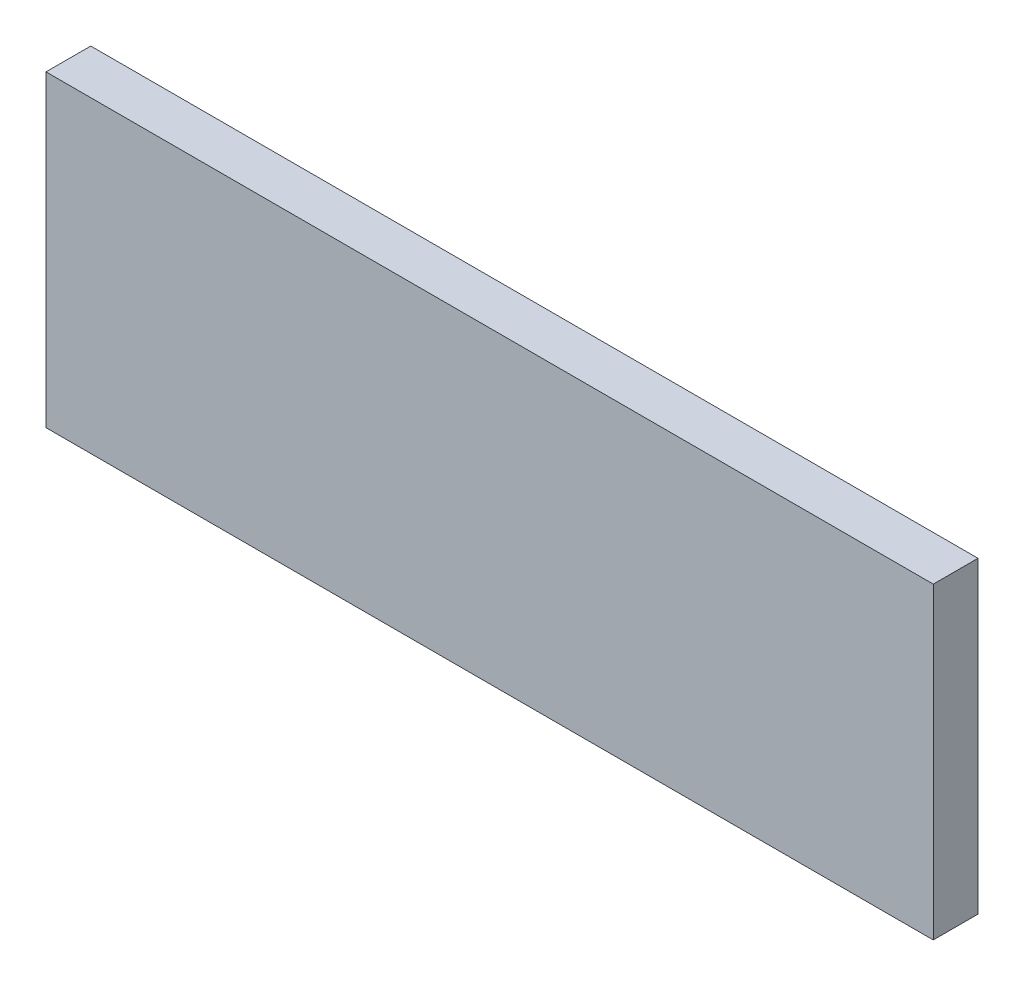
ISO-10303-21;
HEADER;
FILE_DESCRIPTION(('STEP AP214'),'2;1');
FILE_NAME('part.step','',(''),(''),'','','');
FILE_SCHEMA(('AUTOMOTIVE_DESIGN { 1 0 10303 214 1 1 1 1 }'));
ENDSEC;
DATA;
#1=APPLICATION_CONTEXT('core data for automotive mechanical design processes');
#2=APPLICATION_PROTOCOL_DEFINITION('international standard','automotive_design',2000,#1);
#3=PRODUCT_CONTEXT('',#1,'mechanical');
#4=PRODUCT('Part','Part','',(#3));
#5=PRODUCT_RELATED_PRODUCT_CATEGORY('part','',(#4));
#6=PRODUCT_DEFINITION_FORMATION('','',#4);
#7=PRODUCT_DEFINITION_CONTEXT('part definition',#1,'design');
#8=PRODUCT_DEFINITION('design','',#6,#7);
#9=PRODUCT_DEFINITION_SHAPE('','',#8);
#10=(LENGTH_UNIT() NAMED_UNIT(*) SI_UNIT(.MILLI.,.METRE.));
#11=(NAMED_UNIT(*) PLANE_ANGLE_UNIT() SI_UNIT($,.RADIAN.));
#12=(NAMED_UNIT(*) SI_UNIT($,.STERADIAN.) SOLID_ANGLE_UNIT());
#13=UNCERTAINTY_MEASURE_WITH_UNIT(LENGTH_MEASURE(1.E-05),#10,'distance_accuracy_value','');
#14=(GEOMETRIC_REPRESENTATION_CONTEXT(3) GLOBAL_UNCERTAINTY_ASSIGNED_CONTEXT((#13)) GLOBAL_UNIT_ASSIGNED_CONTEXT((#10,
#11,#12)) REPRESENTATION_CONTEXT('',''));
#15=CARTESIAN_POINT('',(0.,0.,0.));
#16=DIRECTION('',(0.,0.,1.));
#17=DIRECTION('',(1.,0.,0.));
#18=AXIS2_PLACEMENT_3D('',#15,#16,#17);
#19=CARTESIAN_POINT('',(339.264989548572,-116.399281235102,18.));
#20=DIRECTION('',(-1.,0.,0.));
#21=DIRECTION('',(0.,0.,1.));
#22=AXIS2_PLACEMENT_3D('',#19,#20,#21);
#23=PLANE('',#22);
#24=DIRECTION('',(0.,1.,0.));
#25=VECTOR('',#24,1.);
#26=CARTESIAN_POINT('',(339.264989548572,-116.399281235102,0.));
#27=LINE('',#26,#25);
#28=CARTESIAN_POINT('',(339.264989548572,-116.399281235102,0.));
#29=VERTEX_POINT('',#28);
#30=CARTESIAN_POINT('',(339.264989548572,7.60071876489792,0.));
#31=VERTEX_POINT('',#30);
#32=EDGE_CURVE('E98',#29,#31,#27,.T.);
#33=ORIENTED_EDGE('',*,*,#32,.T.);
#34=DIRECTION('',(0.,0.,-1.));
#35=VECTOR('',#34,1.);
#36=CARTESIAN_POINT('',(339.264989548572,7.60071876489792,18.));
#37=LINE('',#36,#35);
#38=CARTESIAN_POINT('',(339.264989548572,7.60071876489792,18.));
#39=VERTEX_POINT('',#38);
#40=EDGE_CURVE('E11',#39,#31,#37,.T.);
#41=ORIENTED_EDGE('',*,*,#40,.F.);
#42=DIRECTION('',(0.,1.,0.));
#43=VECTOR('',#42,1.);
#44=CARTESIAN_POINT('',(339.264989548572,-116.399281235102,18.));
#45=LINE('',#44,#43);
#46=CARTESIAN_POINT('',(339.264989548572,-116.399281235102,18.));
#47=VERTEX_POINT('',#46);
#48=EDGE_CURVE('E86',#47,#39,#45,.T.);
#49=ORIENTED_EDGE('',*,*,#48,.F.);
#50=DIRECTION('',(0.,0.,-1.));
#51=VECTOR('',#50,1.);
#52=CARTESIAN_POINT('',(339.264989548572,-116.399281235102,18.));
#53=LINE('',#52,#51);
#54=EDGE_CURVE('E94',#47,#29,#53,.T.);
#55=ORIENTED_EDGE('',*,*,#54,.T.);
#56=EDGE_LOOP('',(#33,#41,#49,#55));
#57=FACE_BOUND('',#56,.T.);
#58=ADVANCED_FACE('F35',(#57),#23,.F.);
#59=CARTESIAN_POINT('',(339.264989548572,7.60071876489792,18.));
#60=DIRECTION('',(0.,-1.,0.));
#61=DIRECTION('',(1.,0.,0.));
#62=AXIS2_PLACEMENT_3D('',#59,#60,#61);
#63=PLANE('',#62);
#64=DIRECTION('',(-1.,0.,0.));
#65=VECTOR('',#64,1.);
#66=CARTESIAN_POINT('',(339.264989548572,7.60071876489792,0.));
#67=LINE('',#66,#65);
#68=CARTESIAN_POINT('',(-17.7350104514283,7.60071876489787,0.));
#69=VERTEX_POINT('',#68);
#70=EDGE_CURVE('E90',#31,#69,#67,.T.);
#71=ORIENTED_EDGE('',*,*,#70,.T.);
#72=DIRECTION('',(0.,0.,-1.));
#73=VECTOR('',#72,1.);
#74=CARTESIAN_POINT('',(-17.7350104514283,7.60071876489787,18.));
#75=LINE('',#74,#73);
#76=CARTESIAN_POINT('',(-17.7350104514283,7.60071876489787,18.));
#77=VERTEX_POINT('',#76);
#78=EDGE_CURVE('E43',#77,#69,#75,.T.);
#79=ORIENTED_EDGE('',*,*,#78,.F.);
#80=DIRECTION('',(-1.,0.,0.));
#81=VECTOR('',#80,1.);
#82=CARTESIAN_POINT('',(339.264989548572,7.60071876489792,18.));
#83=LINE('',#82,#81);
#84=EDGE_CURVE('E81',#39,#77,#83,.T.);
#85=ORIENTED_EDGE('',*,*,#84,.F.);
#86=ORIENTED_EDGE('',*,*,#40,.T.);
#87=EDGE_LOOP('',(#71,#79,#85,#86));
#88=FACE_BOUND('',#87,.T.);
#89=ADVANCED_FACE('F89',(#88),#63,.F.);
#90=CARTESIAN_POINT('',(-17.7350104514283,-116.399281235102,18.));
#91=DIRECTION('',(1.,0.,0.));
#92=DIRECTION('',(0.,0.,-1.));
#93=AXIS2_PLACEMENT_3D('',#90,#91,#92);
#94=PLANE('',#93);
#95=DIRECTION('',(0.,-1.,0.));
#96=VECTOR('',#95,1.);
#97=CARTESIAN_POINT('',(-17.7350104514283,-116.399281235102,0.));
#98=LINE('',#97,#96);
#99=CARTESIAN_POINT('',(-17.7350104514283,-116.399281235102,0.));
#100=VERTEX_POINT('',#99);
#101=EDGE_CURVE('E68',#69,#100,#98,.T.);
#102=ORIENTED_EDGE('',*,*,#101,.T.);
#103=DIRECTION('',(0.,0.,-1.));
#104=VECTOR('',#103,1.);
#105=CARTESIAN_POINT('',(-17.7350104514283,-116.399281235102,18.));
#106=LINE('',#105,#104);
#107=CARTESIAN_POINT('',(-17.7350104514283,-116.399281235102,18.));
#108=VERTEX_POINT('',#107);
#109=EDGE_CURVE('E91',#108,#100,#106,.T.);
#110=ORIENTED_EDGE('',*,*,#109,.F.);
#111=DIRECTION('',(0.,-1.,0.));
#112=VECTOR('',#111,1.);
#113=CARTESIAN_POINT('',(-17.7350104514283,-116.399281235102,18.));
#114=LINE('',#113,#112);
#115=EDGE_CURVE('E84',#77,#108,#114,.T.);
#116=ORIENTED_EDGE('',*,*,#115,.F.);
#117=ORIENTED_EDGE('',*,*,#78,.T.);
#118=EDGE_LOOP('',(#102,#110,#116,#117));
#119=FACE_BOUND('',#118,.T.);
#120=ADVANCED_FACE('F92',(#119),#94,.F.);
#121=CARTESIAN_POINT('',(339.264989548572,-116.399281235102,18.));
#122=DIRECTION('',(0.,1.,0.));
#123=DIRECTION('',(-1.,0.,0.));
#124=AXIS2_PLACEMENT_3D('',#121,#122,#123);
#125=PLANE('',#124);
#126=DIRECTION('',(1.,0.,0.));
#127=VECTOR('',#126,1.);
#128=CARTESIAN_POINT('',(339.264989548572,-116.399281235102,0.));
#129=LINE('',#128,#127);
#130=EDGE_CURVE('E74',#100,#29,#129,.T.);
#131=ORIENTED_EDGE('',*,*,#130,.T.);
#132=ORIENTED_EDGE('',*,*,#54,.F.);
#133=DIRECTION('',(1.,0.,0.));
#134=VECTOR('',#133,1.);
#135=CARTESIAN_POINT('',(339.264989548572,-116.399281235102,18.));
#136=LINE('',#135,#134);
#137=EDGE_CURVE('E51',#108,#47,#136,.T.);
#138=ORIENTED_EDGE('',*,*,#137,.F.);
#139=ORIENTED_EDGE('',*,*,#109,.T.);
#140=EDGE_LOOP('',(#131,#132,#138,#139));
#141=FACE_BOUND('',#140,.T.);
#142=ADVANCED_FACE('F105',(#141),#125,.F.);
#143=CARTESIAN_POINT('',(0.,0.,18.));
#144=DIRECTION('',(0.,0.,1.));
#145=DIRECTION('',(1.,0.,0.));
#146=AXIS2_PLACEMENT_3D('',#143,#144,#145);
#147=PLANE('',#146);
#148=ORIENTED_EDGE('',*,*,#48,.T.);
#149=ORIENTED_EDGE('',*,*,#84,.T.);
#150=ORIENTED_EDGE('',*,*,#115,.T.);
#151=ORIENTED_EDGE('',*,*,#137,.T.);
#152=EDGE_LOOP('',(#148,#149,#150,#151));
#153=FACE_BOUND('',#152,.T.);
#154=ADVANCED_FACE('F82',(#153),#147,.T.);
#155=CARTESIAN_POINT('',(0.,0.,0.));
#156=DIRECTION('',(0.,0.,1.));
#157=DIRECTION('',(1.,0.,0.));
#158=AXIS2_PLACEMENT_3D('',#155,#156,#157);
#159=PLANE('',#158);
#160=ORIENTED_EDGE('',*,*,#32,.F.);
#161=ORIENTED_EDGE('',*,*,#130,.F.);
#162=ORIENTED_EDGE('',*,*,#101,.F.);
#163=ORIENTED_EDGE('',*,*,#70,.F.);
#164=EDGE_LOOP('',(#160,#161,#162,#163));
#165=FACE_BOUND('',#164,.T.);
#166=ADVANCED_FACE('F108',(#165),#159,.F.);
#167=CLOSED_SHELL('',(#58,#89,#120,#142,#154,#166));
#168=MANIFOLD_SOLID_BREP('B2',#167);
#169=ADVANCED_BREP_SHAPE_REPRESENTATION('',(#18,#168),#14);
#170=SHAPE_DEFINITION_REPRESENTATION(#9,#169);
ENDSEC;
END-ISO-10303-21;
